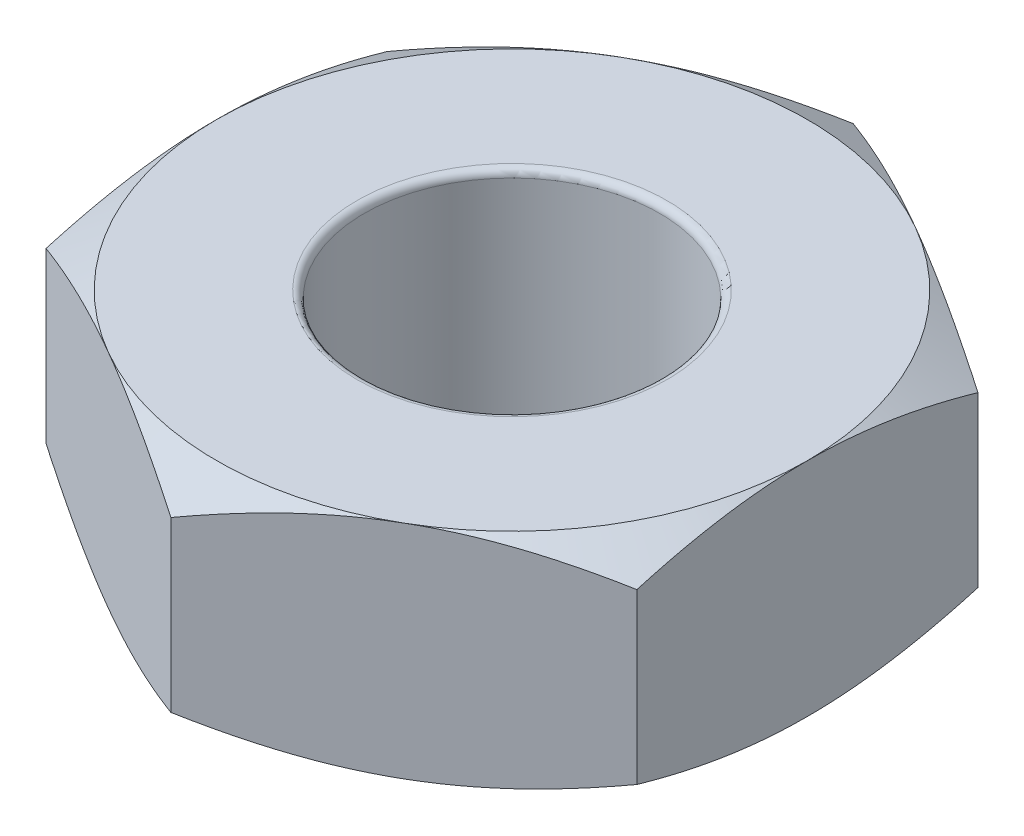
ISO-10303-21;
HEADER;
FILE_DESCRIPTION(('STEP AP214'),'2;1');
FILE_NAME('part.step','',(''),(''),'','','');
FILE_SCHEMA(('AUTOMOTIVE_DESIGN { 1 0 10303 214 1 1 1 1 }'));
ENDSEC;
DATA;
#1=APPLICATION_CONTEXT('core data for automotive mechanical design processes');
#2=APPLICATION_PROTOCOL_DEFINITION('international standard','automotive_design',2000,#1);
#3=PRODUCT_CONTEXT('',#1,'mechanical');
#4=PRODUCT('Part','Part','',(#3));
#5=PRODUCT_RELATED_PRODUCT_CATEGORY('part','',(#4));
#6=PRODUCT_DEFINITION_FORMATION('','',#4);
#7=PRODUCT_DEFINITION_CONTEXT('part definition',#1,'design');
#8=PRODUCT_DEFINITION('design','',#6,#7);
#9=PRODUCT_DEFINITION_SHAPE('','',#8);
#10=(LENGTH_UNIT() NAMED_UNIT(*) SI_UNIT(.MILLI.,.METRE.));
#11=(NAMED_UNIT(*) PLANE_ANGLE_UNIT() SI_UNIT($,.RADIAN.));
#12=(NAMED_UNIT(*) SI_UNIT($,.STERADIAN.) SOLID_ANGLE_UNIT());
#13=UNCERTAINTY_MEASURE_WITH_UNIT(LENGTH_MEASURE(1.E-05),#10,'distance_accuracy_value','');
#14=(GEOMETRIC_REPRESENTATION_CONTEXT(3) GLOBAL_UNCERTAINTY_ASSIGNED_CONTEXT((#13)) GLOBAL_UNIT_ASSIGNED_CONTEXT((#10,
#11,#12)) REPRESENTATION_CONTEXT('',''));
#15=CARTESIAN_POINT('',(0.,0.,0.));
#16=DIRECTION('',(0.,0.,1.));
#17=DIRECTION('',(1.,0.,0.));
#18=AXIS2_PLACEMENT_3D('',#15,#16,#17);
#19=CARTESIAN_POINT('',(0.,1.5,2.3094010767585));
#20=DIRECTION('',(-0.5,0.,-0.866025403784439));
#21=DIRECTION('',(-0.866025403784439,0.,0.5));
#22=AXIS2_PLACEMENT_3D('',#19,#20,#21);
#23=PLANE('',#22);
#24=CARTESIAN_POINT('',(2.0002,0.178699466620498,1.15458506832542));
#25=CARTESIAN_POINT('',(1.91230873709994,0.149389536100679,1.20532911262018));
#26=CARTESIAN_POINT('',(1.82365880552641,0.122732851980467,1.2565111744778));
#27=CARTESIAN_POINT('',(1.6448237530022,0.0762024910207216,1.3597616401932));
#28=CARTESIAN_POINT('',(1.55463545349496,0.0563452763827799,1.41183187919145));
#29=CARTESIAN_POINT('',(1.37537661423669,0.0254334640232534,1.51532701829183));
#30=CARTESIAN_POINT('',(1.2863336617737,0.014173151598532,1.56673599086578));
#31=CARTESIAN_POINT('',(1.10782860221496,0.0007286625946427,1.66979593505373));
#32=CARTESIAN_POINT('',(1.01836714429604,-0.00146664504653102,1.72144653186531));
#33=CARTESIAN_POINT('',(0.851191646451202,0.00309098933064962,1.81796535054794));
#34=CARTESIAN_POINT('',(0.773452629734216,0.00872487468701546,1.86284799277603));
#35=CARTESIAN_POINT('',(0.618481085463866,0.0265838952608292,1.95232085557725));
#36=CARTESIAN_POINT('',(0.541249094258801,0.0388151360234401,1.99691076648954));
#37=CARTESIAN_POINT('',(0.385957813517799,0.0693934368676104,2.08656822922816));
#38=CARTESIAN_POINT('',(0.30791818689262,0.0878701670657164,2.13162442866767));
#39=CARTESIAN_POINT('',(0.153003134307865,0.129805518212856,2.221064675979));
#40=CARTESIAN_POINT('',(0.0761257223768796,0.153254280492314,2.26544987045196));
#41=CARTESIAN_POINT('',(-0.000200000000000661,0.178699466620498,2.30951654681234));
#42=B_SPLINE_CURVE_WITH_KNOTS('',3,(#24,#25,#26,#27,#28,#29,#30,#31,#32,#33,#34,#35,#36,#37,#38,
#39,#40,#41),.UNSPECIFIED.,.F.,.F.,(4,2,2,2,2,2,2,2,4),(0.,0.31703182469561,0.634825876346563,
0.944753967652636,1.25430138000371,1.52387047293094,1.79368946861028,2.06949491027634,
2.34475850821472),.UNSPECIFIED.);
#43=CARTESIAN_POINT('',(2.,0.178632794954081,1.15470053837925));
#44=VERTEX_POINT('',#43);
#45=CARTESIAN_POINT('',(0.999999999999999,0.,1.73205080756888));
#46=VERTEX_POINT('',#45);
#47=EDGE_CURVE('E126',#44,#46,#42,.T.);
#48=ORIENTED_EDGE('',*,*,#47,.F.);
#49=DIRECTION('',(0.,-1.,0.));
#50=VECTOR('',#49,1.);
#51=CARTESIAN_POINT('',(2.,1.5,1.15470053837925));
#52=LINE('',#51,#50);
#53=CARTESIAN_POINT('',(2.,1.32136720504592,1.15470053837925));
#54=VERTEX_POINT('',#53);
#55=EDGE_CURVE('E232',#54,#44,#52,.T.);
#56=ORIENTED_EDGE('',*,*,#55,.F.);
#57=CARTESIAN_POINT('',(-0.000200000000000738,1.3213005333795,2.30951654681234));
#58=CARTESIAN_POINT('',(0.0876912629000595,1.35061046389932,2.25877250251758));
#59=CARTESIAN_POINT('',(0.176341194473591,1.37726714801953,2.20759044065996));
#60=CARTESIAN_POINT('',(0.355176246997802,1.42379750897928,2.10433997494456));
#61=CARTESIAN_POINT('',(0.445364546505036,1.44365472361722,2.05226973594631));
#62=CARTESIAN_POINT('',(0.624623385763305,1.47456653597675,1.94877459684592));
#63=CARTESIAN_POINT('',(0.713666338226303,1.48582684840147,1.89736562427197));
#64=CARTESIAN_POINT('',(0.892171397785043,1.49927133740536,1.79430568008403));
#65=CARTESIAN_POINT('',(0.981632855703958,1.50146664504653,1.74265508327244));
#66=CARTESIAN_POINT('',(1.1488083535488,1.49690901066935,1.64613626458982));
#67=CARTESIAN_POINT('',(1.22654737026578,1.49127512531298,1.60125362236173));
#68=CARTESIAN_POINT('',(1.38151891453613,1.47341610473917,1.51178075956051));
#69=CARTESIAN_POINT('',(1.4587509057412,1.46118486397656,1.46719084864821));
#70=CARTESIAN_POINT('',(1.6140421864822,1.43060656313239,1.37753338590959));
#71=CARTESIAN_POINT('',(1.69208181310738,1.41212983293428,1.33247718647009));
#72=CARTESIAN_POINT('',(1.84699686569213,1.37019448178714,1.24303693915876));
#73=CARTESIAN_POINT('',(1.92387427762312,1.34674571950769,1.1986517446858));
#74=CARTESIAN_POINT('',(2.0002,1.3213005333795,1.15458506832542));
#75=B_SPLINE_CURVE_WITH_KNOTS('',3,(#57,#58,#59,#60,#61,#62,#63,#64,#65,#66,#67,#68,#69,#70,#71,
#72,#73,#74),.UNSPECIFIED.,.F.,.F.,(4,2,2,2,2,2,2,2,4),(0.,0.31703182469561,0.634825876346563,
0.944753967652636,1.25430138000371,1.52387047293094,1.79368946861028,2.06949491027634,
2.34475850821472),.UNSPECIFIED.);
#76=CARTESIAN_POINT('',(1.,1.5,1.73205080756888));
#77=VERTEX_POINT('',#76);
#78=EDGE_CURVE('E373',#77,#54,#75,.T.);
#79=ORIENTED_EDGE('',*,*,#78,.F.);
#80=CARTESIAN_POINT('',(0.,1.32136720504592,2.3094010767585));
#81=VERTEX_POINT('',#80);
#82=EDGE_CURVE('E362',#81,#77,#75,.T.);
#83=ORIENTED_EDGE('',*,*,#82,.F.);
#84=DIRECTION('',(0.,-1.,0.));
#85=VECTOR('',#84,1.);
#86=CARTESIAN_POINT('',(0.,1.5,2.3094010767585));
#87=LINE('',#86,#85);
#88=CARTESIAN_POINT('',(0.,0.178632794954081,2.3094010767585));
#89=VERTEX_POINT('',#88);
#90=EDGE_CURVE('E161',#81,#89,#87,.T.);
#91=ORIENTED_EDGE('',*,*,#90,.T.);
#92=EDGE_CURVE('E139',#46,#89,#42,.T.);
#93=ORIENTED_EDGE('',*,*,#92,.F.);
#94=EDGE_LOOP('',(#48,#56,#79,#83,#91,#93));
#95=FACE_BOUND('',#94,.T.);
#96=ADVANCED_FACE('F37',(#95),#23,.F.);
#97=CARTESIAN_POINT('',(2.,1.5,1.15470053837925));
#98=DIRECTION('',(-1.,0.,0.));
#99=DIRECTION('',(0.,0.,1.));
#100=AXIS2_PLACEMENT_3D('',#97,#98,#99);
#101=PLANE('',#100);
#102=CARTESIAN_POINT('',(2.,1.38024356206323,-3.90868581202231));
#103=CARTESIAN_POINT('',(2.,1.33338477520942,-3.81751112169325));
#104=CARTESIAN_POINT('',(2.,1.28679021631781,-3.72620145046507));
#105=CARTESIAN_POINT('',(2.,1.19424910626193,-3.54325228824929));
#106=CARTESIAN_POINT('',(2.,1.14830256761152,-3.45161279093522));
#107=CARTESIAN_POINT('',(2.,1.01146715761723,-3.17581300243889));
#108=CARTESIAN_POINT('',(2.,0.921737415753044,-2.9910709203634));
#109=CARTESIAN_POINT('',(2.,0.788409395654005,-2.70743624323685));
#110=CARTESIAN_POINT('',(2.,0.743100656319978,-2.60934831774003));
#111=CARTESIAN_POINT('',(2.,0.654163775473777,-2.41241507533712));
#112=CARTESIAN_POINT('',(2.,0.610535569794257,-2.31356978752232));
#113=CARTESIAN_POINT('',(2.,0.525465312630819,-2.11501734395706));
#114=CARTESIAN_POINT('',(2.,0.484021797433511,-2.0153108187193));
#115=CARTESIAN_POINT('',(2.,0.403937006613858,-1.81474539793162));
#116=CARTESIAN_POINT('',(2.,0.365296392668009,-1.71388623674348));
#117=CARTESIAN_POINT('',(2.,0.285617620657406,-1.49400593807688));
#118=CARTESIAN_POINT('',(2.,0.245241020544741,-1.37474151517002));
#119=CARTESIAN_POINT('',(2.,0.171425178991217,-1.13410850020832));
#120=CARTESIAN_POINT('',(2.,0.137982386760639,-1.0127410198025));
#121=CARTESIAN_POINT('',(2.,0.0810163135177487,-0.770071934944817));
#122=CARTESIAN_POINT('',(2.,0.0573164449831604,-0.648812992268316));
#123=CARTESIAN_POINT('',(2.,0.0214266196550799,-0.404608758962328));
#124=CARTESIAN_POINT('',(2.,0.00922997508793512,-0.281664490388411));
#125=CARTESIAN_POINT('',(2.,-0.00207085477321416,-0.0335419748269813));
#126=CARTESIAN_POINT('',(2.,-0.00100267071105161,0.0916445286709646));
#127=CARTESIAN_POINT('',(2.,0.014484045237909,0.341193409529001));
#128=CARTESIAN_POINT('',(2.,0.0289073543713882,0.465555475947227));
#129=CARTESIAN_POINT('',(2.,0.0695474304125029,0.714833183390077));
#130=CARTESIAN_POINT('',(2.,0.0959955839540994,0.839709642184881));
#131=CARTESIAN_POINT('',(2.,0.157986894429598,1.08715459095749));
#132=CARTESIAN_POINT('',(2.,0.193532661864587,1.20972240762972));
#133=CARTESIAN_POINT('',(2.,0.269280519283634,1.44650470413582));
#134=CARTESIAN_POINT('',(2.,0.309153182000627,1.56082665519536));
#135=CARTESIAN_POINT('',(2.,0.393292544621002,1.78785420479763));
#136=CARTESIAN_POINT('',(2.,0.437560254612616,1.90055942493322));
#137=CARTESIAN_POINT('',(2.,0.529372373860237,2.12474648121528));
#138=CARTESIAN_POINT('',(2.,0.576919977737399,2.23622699843601));
#139=CARTESIAN_POINT('',(2.,0.674434984945331,2.45812606854002));
#140=CARTESIAN_POINT('',(2.,0.724402516378928,2.56854456483182));
#141=CARTESIAN_POINT('',(2.,0.823331957292793,2.78238975570627));
#142=CARTESIAN_POINT('',(2.,0.87219431445944,2.88586269009035));
#143=CARTESIAN_POINT('',(2.,0.971202074310625,3.09219555395059));
#144=CARTESIAN_POINT('',(2.,1.02134751719606,3.19505546409504));
#145=CARTESIAN_POINT('',(2.,1.12249261908677,3.39994809054478));
#146=CARTESIAN_POINT('',(2.,1.1734890679984,3.50198239517474));
#147=CARTESIAN_POINT('',(2.,1.27629914354312,3.70562803087648));
#148=CARTESIAN_POINT('',(2.,1.32811270118693,3.80723939675146));
#149=CARTESIAN_POINT('',(2.,1.38024356206323,3.90868581202231));
#150=B_SPLINE_CURVE_WITH_KNOTS('',3,(#102,#103,#104,#105,#106,#107,#108,#109,#110,#111,#112,
#113,#114,#115,#116,#117,#118,#119,#120,#121,#122,#123,#124,#125,#126,#127,#128,#129,#130,#131,
#132,#133,#134,#135,#136,#137,#138,#139,#140,#141,#142,#143,#144,#145,#146,#147,#148,#149),
.UNSPECIFIED.,.F.,.F.,(4,2,2,2,2,2,2,2,2,2,2,2,2,2,2,2,2,2,2,2,2,2,2,4),(0.,0.307531563856156,
0.615069058317579,1.23115557383005,1.55528461857819,1.8794012749051,2.2032979430231,
2.52727082574406,2.9048604545366,3.28225624019068,3.65247322929854,4.02247484779028,
4.39728941630346,4.77223811112903,5.15472880172826,5.53732936883045,5.90044039858863,
6.26363507408059,6.6271886376078,6.99076146751935,7.33404016464889,7.67732963038956,
8.01953135999518,8.36170435024386),.UNSPECIFIED.);
#151=CARTESIAN_POINT('',(2.,0.178632794954081,-1.15470053837925));
#152=VERTEX_POINT('',#151);
#153=CARTESIAN_POINT('',(2.,0.,0.));
#154=VERTEX_POINT('',#153);
#155=EDGE_CURVE('E52',#152,#154,#150,.T.);
#156=ORIENTED_EDGE('',*,*,#155,.F.);
#157=DIRECTION('',(0.,-1.,0.));
#158=VECTOR('',#157,1.);
#159=CARTESIAN_POINT('',(2.,1.5,-1.15470053837925));
#160=LINE('',#159,#158);
#161=CARTESIAN_POINT('',(2.,1.32136720504592,-1.15470053837925));
#162=VERTEX_POINT('',#161);
#163=EDGE_CURVE('E365',#162,#152,#160,.T.);
#164=ORIENTED_EDGE('',*,*,#163,.F.);
#165=CARTESIAN_POINT('',(2.,0.119756437936774,3.90868581202231));
#166=CARTESIAN_POINT('',(2.,0.166615224790583,3.81751112169325));
#167=CARTESIAN_POINT('',(2.,0.213209783682192,3.72620145046507));
#168=CARTESIAN_POINT('',(2.,0.305750893738073,3.54325228824929));
#169=CARTESIAN_POINT('',(2.,0.351697432388483,3.45161279093522));
#170=CARTESIAN_POINT('',(2.,0.488532842382773,3.1758130024389));
#171=CARTESIAN_POINT('',(2.,0.578262584246956,2.9910709203634));
#172=CARTESIAN_POINT('',(2.,0.711590604345995,2.70743624323685));
#173=CARTESIAN_POINT('',(2.,0.756899343680022,2.60934831774003));
#174=CARTESIAN_POINT('',(2.,0.845836224526223,2.41241507533712));
#175=CARTESIAN_POINT('',(2.,0.889464430205743,2.31356978752232));
#176=CARTESIAN_POINT('',(2.,0.97453468736918,2.11501734395706));
#177=CARTESIAN_POINT('',(2.,1.01597820256649,2.0153108187193));
#178=CARTESIAN_POINT('',(2.,1.09606299338614,1.81474539793162));
#179=CARTESIAN_POINT('',(2.,1.13470360733199,1.71388623674348));
#180=CARTESIAN_POINT('',(2.,1.21438237934259,1.49400593807688));
#181=CARTESIAN_POINT('',(2.,1.25475897945526,1.37474151517002));
#182=CARTESIAN_POINT('',(2.,1.32857482100878,1.13410850020832));
#183=CARTESIAN_POINT('',(2.,1.36201761323936,1.0127410198025));
#184=CARTESIAN_POINT('',(2.,1.41898368648225,0.770071934944819));
#185=CARTESIAN_POINT('',(2.,1.44268355501684,0.648812992268318));
#186=CARTESIAN_POINT('',(2.,1.47857338034492,0.40460875896233));
#187=CARTESIAN_POINT('',(2.,1.49077002491207,0.281664490388413));
#188=CARTESIAN_POINT('',(2.,1.50207085477321,0.0335419748269832));
#189=CARTESIAN_POINT('',(2.,1.50100267071105,-0.0916445286709627));
#190=CARTESIAN_POINT('',(2.,1.48551595476209,-0.341193409528999));
#191=CARTESIAN_POINT('',(2.,1.47109264562861,-0.465555475947225));
#192=CARTESIAN_POINT('',(2.,1.4304525695875,-0.714833183390076));
#193=CARTESIAN_POINT('',(2.,1.4040044160459,-0.83970964218488));
#194=CARTESIAN_POINT('',(2.,1.3420131055704,-1.08715459095749));
#195=CARTESIAN_POINT('',(2.,1.30646733813541,-1.20972240762972));
#196=CARTESIAN_POINT('',(2.,1.23071948071637,-1.44650470413582));
#197=CARTESIAN_POINT('',(2.,1.19084681799937,-1.56082665519536));
#198=CARTESIAN_POINT('',(2.,1.106707455379,-1.78785420479763));
#199=CARTESIAN_POINT('',(2.,1.06243974538738,-1.90055942493322));
#200=CARTESIAN_POINT('',(2.,0.970627626139764,-2.12474648121528));
#201=CARTESIAN_POINT('',(2.,0.923080022262602,-2.23622699843601));
#202=CARTESIAN_POINT('',(2.,0.825565015054669,-2.45812606854002));
#203=CARTESIAN_POINT('',(2.,0.775597483621072,-2.56854456483182));
#204=CARTESIAN_POINT('',(2.,0.676668042707207,-2.78238975570627));
#205=CARTESIAN_POINT('',(2.,0.62780568554056,-2.88586269009035));
#206=CARTESIAN_POINT('',(2.,0.528797925689375,-3.09219555395059));
#207=CARTESIAN_POINT('',(2.,0.478652482803937,-3.19505546409504));
#208=CARTESIAN_POINT('',(2.,0.377507380913226,-3.39994809054478));
#209=CARTESIAN_POINT('',(2.,0.3265109320016,-3.50198239517474));
#210=CARTESIAN_POINT('',(2.,0.223700856456884,-3.70562803087648));
#211=CARTESIAN_POINT('',(2.,0.171887298813068,-3.80723939675146));
#212=CARTESIAN_POINT('',(2.,0.119756437936775,-3.90868581202231));
#213=B_SPLINE_CURVE_WITH_KNOTS('',3,(#165,#166,#167,#168,#169,#170,#171,#172,#173,#174,#175,
#176,#177,#178,#179,#180,#181,#182,#183,#184,#185,#186,#187,#188,#189,#190,#191,#192,#193,#194,
#195,#196,#197,#198,#199,#200,#201,#202,#203,#204,#205,#206,#207,#208,#209,#210,#211,#212),
.UNSPECIFIED.,.F.,.F.,(4,2,2,2,2,2,2,2,2,2,2,2,2,2,2,2,2,2,2,2,2,2,2,4),(0.,0.307531563856156,
0.615069058317579,1.23115557383005,1.55528461857819,1.8794012749051,2.2032979430231,
2.52727082574406,2.9048604545366,3.28225624019068,3.65247322929854,4.02247484779028,
4.39728941630346,4.77223811112903,5.15472880172826,5.53732936883045,5.90044039858863,
6.2636350740806,6.6271886376078,6.99076146751935,7.33404016464889,7.67732963038957,
8.01953135999518,8.36170435024386),.UNSPECIFIED.);
#214=CARTESIAN_POINT('',(2.,1.5,0.));
#215=VERTEX_POINT('',#214);
#216=EDGE_CURVE('E272',#215,#162,#213,.T.);
#217=ORIENTED_EDGE('',*,*,#216,.F.);
#218=EDGE_CURVE('E372',#54,#215,#213,.T.);
#219=ORIENTED_EDGE('',*,*,#218,.F.);
#220=ORIENTED_EDGE('',*,*,#55,.T.);
#221=EDGE_CURVE('E133',#154,#44,#150,.T.);
#222=ORIENTED_EDGE('',*,*,#221,.F.);
#223=EDGE_LOOP('',(#156,#164,#217,#219,#220,#222));
#224=FACE_BOUND('',#223,.T.);
#225=ADVANCED_FACE('F257',(#224),#101,.F.);
#226=CARTESIAN_POINT('',(2.,1.5,-1.15470053837925));
#227=DIRECTION('',(-0.5,0.,0.866025403784438));
#228=DIRECTION('',(0.866025403784439,0.,0.5));
#229=AXIS2_PLACEMENT_3D('',#226,#227,#228);
#230=PLANE('',#229);
#231=CARTESIAN_POINT('',(-0.0002,0.178699466620498,-2.30951654681234));
#232=CARTESIAN_POINT('',(0.0876912629000601,0.14938953610068,-2.25877250251758));
#233=CARTESIAN_POINT('',(0.176341194473591,0.122732851980468,-2.20759044065996));
#234=CARTESIAN_POINT('',(0.355176246997802,0.0762024910207219,-2.10433997494456));
#235=CARTESIAN_POINT('',(0.445364546505037,0.05634527638278,-2.05226973594631));
#236=CARTESIAN_POINT('',(0.624623385763306,0.0254334640232533,-1.94877459684592));
#237=CARTESIAN_POINT('',(0.713666338226304,0.0141731515985319,-1.89736562427197));
#238=CARTESIAN_POINT('',(0.892171397785043,0.000728662594642689,-1.79430568008402));
#239=CARTESIAN_POINT('',(0.981632855703958,-0.00146664504653088,-1.74265508327244));
#240=CARTESIAN_POINT('',(1.1488083535488,0.00309098933064962,-1.64613626458981));
#241=CARTESIAN_POINT('',(1.22654737026578,0.00872487468701521,-1.60125362236173));
#242=CARTESIAN_POINT('',(1.38151891453613,0.0265838952608289,-1.51178075956051));
#243=CARTESIAN_POINT('',(1.4587509057412,0.03881513602344,-1.46719084864821));
#244=CARTESIAN_POINT('',(1.6140421864822,0.0693934368676104,-1.37753338590959));
#245=CARTESIAN_POINT('',(1.69208181310738,0.0878701670657164,-1.33247718647009));
#246=CARTESIAN_POINT('',(1.84699686569214,0.129805518212856,-1.24303693915875));
#247=CARTESIAN_POINT('',(1.92387427762312,0.153254280492314,-1.1986517446858));
#248=CARTESIAN_POINT('',(2.0002,0.178699466620498,-1.15458506832541));
#249=B_SPLINE_CURVE_WITH_KNOTS('',3,(#231,#232,#233,#234,#235,#236,#237,#238,#239,#240,#241,
#242,#243,#244,#245,#246,#247,#248),.UNSPECIFIED.,.F.,.F.,(4,2,2,2,2,2,2,2,4),(0.,
0.31703182469561,0.634825876346564,0.944753967652636,1.25430138000371,1.52387047293094,
1.79368946861028,2.06949491027634,2.34475850821472),.UNSPECIFIED.);
#250=CARTESIAN_POINT('',(0.,0.178632794954082,-2.3094010767585));
#251=VERTEX_POINT('',#250);
#252=CARTESIAN_POINT('',(1.,0.,-1.73205080756888));
#253=VERTEX_POINT('',#252);
#254=EDGE_CURVE('E60',#251,#253,#249,.T.);
#255=ORIENTED_EDGE('',*,*,#254,.F.);
#256=DIRECTION('',(0.,-1.,0.));
#257=VECTOR('',#256,1.);
#258=CARTESIAN_POINT('',(0.,1.5,-2.3094010767585));
#259=LINE('',#258,#257);
#260=CARTESIAN_POINT('',(0.,1.32136720504592,-2.3094010767585));
#261=VERTEX_POINT('',#260);
#262=EDGE_CURVE('E360',#261,#251,#259,.T.);
#263=ORIENTED_EDGE('',*,*,#262,.F.);
#264=CARTESIAN_POINT('',(2.0002,1.3213005333795,-1.15458506832541));
#265=CARTESIAN_POINT('',(1.91230873709994,1.35061046389932,-1.20532911262018));
#266=CARTESIAN_POINT('',(1.82365880552641,1.37726714801953,-1.2565111744778));
#267=CARTESIAN_POINT('',(1.6448237530022,1.42379750897928,-1.35976164019319));
#268=CARTESIAN_POINT('',(1.55463545349496,1.44365472361722,-1.41183187919145));
#269=CARTESIAN_POINT('',(1.37537661423669,1.47456653597675,-1.51532701829183));
#270=CARTESIAN_POINT('',(1.2863336617737,1.48582684840147,-1.56673599086578));
#271=CARTESIAN_POINT('',(1.10782860221496,1.49927133740536,-1.66979593505373));
#272=CARTESIAN_POINT('',(1.01836714429604,1.50146664504653,-1.72144653186531));
#273=CARTESIAN_POINT('',(0.851191646451202,1.49690901066935,-1.81796535054794));
#274=CARTESIAN_POINT('',(0.773452629734217,1.49127512531298,-1.86284799277603));
#275=CARTESIAN_POINT('',(0.618481085463867,1.47341610473917,-1.95232085557725));
#276=CARTESIAN_POINT('',(0.541249094258802,1.46118486397656,-1.99691076648954));
#277=CARTESIAN_POINT('',(0.385957813517799,1.43060656313239,-2.08656822922816));
#278=CARTESIAN_POINT('',(0.307918186892621,1.41212983293428,-2.13162442866767));
#279=CARTESIAN_POINT('',(0.153003134307865,1.37019448178714,-2.221064675979));
#280=CARTESIAN_POINT('',(0.07612572237688,1.34674571950769,-2.26544987045196));
#281=CARTESIAN_POINT('',(-0.00020000000000016,1.3213005333795,-2.30951654681234));
#282=B_SPLINE_CURVE_WITH_KNOTS('',3,(#264,#265,#266,#267,#268,#269,#270,#271,#272,#273,#274,
#275,#276,#277,#278,#279,#280,#281),.UNSPECIFIED.,.F.,.F.,(4,2,2,2,2,2,2,2,4),(0.,
0.31703182469561,0.634825876346563,0.944753967652635,1.25430138000371,1.52387047293094,
1.79368946861028,2.06949491027634,2.34475850821472),.UNSPECIFIED.);
#283=CARTESIAN_POINT('',(1.,1.5,-1.73205080756888));
#284=VERTEX_POINT('',#283);
#285=EDGE_CURVE('E321',#284,#261,#282,.T.);
#286=ORIENTED_EDGE('',*,*,#285,.F.);
#287=EDGE_CURVE('E379',#162,#284,#282,.T.);
#288=ORIENTED_EDGE('',*,*,#287,.F.);
#289=ORIENTED_EDGE('',*,*,#163,.T.);
#290=EDGE_CURVE('E199',#253,#152,#249,.T.);
#291=ORIENTED_EDGE('',*,*,#290,.F.);
#292=EDGE_LOOP('',(#255,#263,#286,#288,#289,#291));
#293=FACE_BOUND('',#292,.T.);
#294=ADVANCED_FACE('F261',(#293),#230,.F.);
#295=CARTESIAN_POINT('',(0.,1.5,-2.3094010767585));
#296=DIRECTION('',(0.5,0.,0.866025403784439));
#297=DIRECTION('',(0.866025403784439,0.,-0.5));
#298=AXIS2_PLACEMENT_3D('',#295,#296,#297);
#299=PLANE('',#298);
#300=CARTESIAN_POINT('',(-2.0002,0.178699466620498,-1.15458506832542));
#301=CARTESIAN_POINT('',(-1.91230873709994,0.14938953610068,-1.20532911262018));
#302=CARTESIAN_POINT('',(-1.82365880552641,0.122732851980468,-1.2565111744778));
#303=CARTESIAN_POINT('',(-1.6448237530022,0.0762024910207219,-1.3597616401932));
#304=CARTESIAN_POINT('',(-1.55463545349496,0.0563452763827799,-1.41183187919145));
#305=CARTESIAN_POINT('',(-1.37537661423669,0.0254334640232533,-1.51532701829183));
#306=CARTESIAN_POINT('',(-1.2863336617737,0.0141731515985321,-1.56673599086578));
#307=CARTESIAN_POINT('',(-1.10782860221496,0.000728662594642999,-1.66979593505373));
#308=CARTESIAN_POINT('',(-1.01836714429604,-0.00146664504653067,-1.72144653186531));
#309=CARTESIAN_POINT('',(-0.851191646451202,0.00309098933064985,-1.81796535054794));
#310=CARTESIAN_POINT('',(-0.773452629734217,0.00872487468701556,-1.86284799277603));
#311=CARTESIAN_POINT('',(-0.618481085463867,0.0265838952608294,-1.95232085557725));
#312=CARTESIAN_POINT('',(-0.541249094258802,0.0388151360234405,-1.99691076648954));
#313=CARTESIAN_POINT('',(-0.385957813517799,0.0693934368676109,-2.08656822922816));
#314=CARTESIAN_POINT('',(-0.307918186892621,0.0878701670657169,-2.13162442866767));
#315=CARTESIAN_POINT('',(-0.153003134307865,0.129805518212857,-2.221064675979));
#316=CARTESIAN_POINT('',(-0.07612572237688,0.153254280492314,-2.26544987045196));
#317=CARTESIAN_POINT('',(0.000199999999999946,0.178699466620498,-2.30951654681234));
#318=B_SPLINE_CURVE_WITH_KNOTS('',3,(#300,#301,#302,#303,#304,#305,#306,#307,#308,#309,#310,
#311,#312,#313,#314,#315,#316,#317),.UNSPECIFIED.,.F.,.F.,(4,2,2,2,2,2,2,2,4),(0.,
0.31703182469561,0.634825876346564,0.944753967652636,1.25430138000371,1.52387047293094,
1.79368946861028,2.06949491027634,2.34475850821472),.UNSPECIFIED.);
#319=CARTESIAN_POINT('',(-2.,0.178632794954075,-1.15470053837926));
#320=VERTEX_POINT('',#319);
#321=CARTESIAN_POINT('',(-1.,0.,-1.73205080756888));
#322=VERTEX_POINT('',#321);
#323=EDGE_CURVE('E177',#320,#322,#318,.T.);
#324=ORIENTED_EDGE('',*,*,#323,.F.);
#325=DIRECTION('',(0.,-1.,0.));
#326=VECTOR('',#325,1.);
#327=CARTESIAN_POINT('',(-2.,1.5,-1.15470053837925));
#328=LINE('',#327,#326);
#329=CARTESIAN_POINT('',(-2.,1.32136720504592,-1.15470053837925));
#330=VERTEX_POINT('',#329);
#331=EDGE_CURVE('E328',#330,#320,#328,.T.);
#332=ORIENTED_EDGE('',*,*,#331,.F.);
#333=CARTESIAN_POINT('',(0.000200000000000046,1.3213005333795,-2.30951654681234));
#334=CARTESIAN_POINT('',(-0.08769126290006,1.35061046389932,-2.25877250251758));
#335=CARTESIAN_POINT('',(-0.176341194473591,1.37726714801953,-2.20759044065996));
#336=CARTESIAN_POINT('',(-0.355176246997802,1.42379750897928,-2.10433997494456));
#337=CARTESIAN_POINT('',(-0.445364546505037,1.44365472361722,-2.05226973594631));
#338=CARTESIAN_POINT('',(-0.624623385763306,1.47456653597675,-1.94877459684592));
#339=CARTESIAN_POINT('',(-0.713666338226304,1.48582684840147,-1.89736562427197));
#340=CARTESIAN_POINT('',(-0.892171397785043,1.49927133740536,-1.79430568008403));
#341=CARTESIAN_POINT('',(-0.981632855703959,1.50146664504653,-1.74265508327244));
#342=CARTESIAN_POINT('',(-1.1488083535488,1.49690901066935,-1.64613626458982));
#343=CARTESIAN_POINT('',(-1.22654737026578,1.49127512531298,-1.60125362236173));
#344=CARTESIAN_POINT('',(-1.38151891453613,1.47341610473917,-1.51178075956051));
#345=CARTESIAN_POINT('',(-1.4587509057412,1.46118486397656,-1.46719084864821));
#346=CARTESIAN_POINT('',(-1.6140421864822,1.43060656313239,-1.37753338590959));
#347=CARTESIAN_POINT('',(-1.69208181310738,1.41212983293428,-1.33247718647009));
#348=CARTESIAN_POINT('',(-1.84699686569214,1.37019448178714,-1.24303693915876));
#349=CARTESIAN_POINT('',(-1.92387427762312,1.34674571950769,-1.1986517446858));
#350=CARTESIAN_POINT('',(-2.0002,1.3213005333795,-1.15458506832542));
#351=B_SPLINE_CURVE_WITH_KNOTS('',3,(#333,#334,#335,#336,#337,#338,#339,#340,#341,#342,#343,
#344,#345,#346,#347,#348,#349,#350),.UNSPECIFIED.,.F.,.F.,(4,2,2,2,2,2,2,2,4),(0.,
0.31703182469561,0.634825876346564,0.944753967652636,1.25430138000371,1.52387047293094,
1.79368946861028,2.06949491027634,2.34475850821472),.UNSPECIFIED.);
#352=CARTESIAN_POINT('',(-1.,1.5,-1.73205080756888));
#353=VERTEX_POINT('',#352);
#354=EDGE_CURVE('E312',#353,#330,#351,.T.);
#355=ORIENTED_EDGE('',*,*,#354,.F.);
#356=EDGE_CURVE('E317',#261,#353,#351,.T.);
#357=ORIENTED_EDGE('',*,*,#356,.F.);
#358=ORIENTED_EDGE('',*,*,#262,.T.);
#359=EDGE_CURVE('E283',#322,#251,#318,.T.);
#360=ORIENTED_EDGE('',*,*,#359,.F.);
#361=EDGE_LOOP('',(#324,#332,#355,#357,#358,#360));
#362=FACE_BOUND('',#361,.T.);
#363=ADVANCED_FACE('F266',(#362),#299,.F.);
#364=CARTESIAN_POINT('',(-2.,1.5,-1.15470053837925));
#365=DIRECTION('',(1.,0.,0.));
#366=DIRECTION('',(0.,0.,-1.));
#367=AXIS2_PLACEMENT_3D('',#364,#365,#366);
#368=PLANE('',#367);
#369=CARTESIAN_POINT('',(-2.,1.38024356206322,3.9086858120223));
#370=CARTESIAN_POINT('',(-2.,1.33338477520942,3.81751112169324));
#371=CARTESIAN_POINT('',(-2.,1.28679021631781,3.72620145046507));
#372=CARTESIAN_POINT('',(-2.,1.19424910626193,3.54325228824929));
#373=CARTESIAN_POINT('',(-2.,1.14830256761152,3.45161279093522));
#374=CARTESIAN_POINT('',(-2.,1.01146715761723,3.17581300243889));
#375=CARTESIAN_POINT('',(-2.,0.921737415753044,2.9910709203634));
#376=CARTESIAN_POINT('',(-2.,0.788409395654005,2.70743624323685));
#377=CARTESIAN_POINT('',(-2.,0.743100656319978,2.60934831774002));
#378=CARTESIAN_POINT('',(-2.,0.654163775473777,2.41241507533712));
#379=CARTESIAN_POINT('',(-2.,0.610535569794257,2.31356978752232));
#380=CARTESIAN_POINT('',(-2.,0.52546531263082,2.11501734395706));
#381=CARTESIAN_POINT('',(-2.,0.484021797433511,2.0153108187193));
#382=CARTESIAN_POINT('',(-2.,0.403937006613859,1.81474539793162));
#383=CARTESIAN_POINT('',(-2.,0.36529639266801,1.71388623674348));
#384=CARTESIAN_POINT('',(-2.,0.285617620657407,1.49400593807688));
#385=CARTESIAN_POINT('',(-2.,0.245241020544742,1.37474151517002));
#386=CARTESIAN_POINT('',(-2.,0.171425178991218,1.13410850020832));
#387=CARTESIAN_POINT('',(-2.,0.13798238676064,1.0127410198025));
#388=CARTESIAN_POINT('',(-2.,0.0810163135177492,0.770071934944817));
#389=CARTESIAN_POINT('',(-2.,0.0573164449831608,0.648812992268316));
#390=CARTESIAN_POINT('',(-2.,0.0214266196550805,0.404608758962328));
#391=CARTESIAN_POINT('',(-2.,0.00922997508793581,0.281664490388411));
#392=CARTESIAN_POINT('',(-2.,-0.00207085477321335,0.0335419748269811));
#393=CARTESIAN_POINT('',(-2.,-0.00100267071105085,-0.0916445286709648));
#394=CARTESIAN_POINT('',(-2.,0.0144840452379097,-0.341193409529001));
#395=CARTESIAN_POINT('',(-2.,0.028907354371389,-0.465555475947227));
#396=CARTESIAN_POINT('',(-2.,0.0695474304125037,-0.714833183390078));
#397=CARTESIAN_POINT('',(-2.,0.0959955839541001,-0.839709642184882));
#398=CARTESIAN_POINT('',(-2.,0.157986894429598,-1.08715459095749));
#399=CARTESIAN_POINT('',(-2.,0.193532661864588,-1.20972240762972));
#400=CARTESIAN_POINT('',(-2.,0.269280519283635,-1.44650470413582));
#401=CARTESIAN_POINT('',(-2.,0.309153182000628,-1.56082665519536));
#402=CARTESIAN_POINT('',(-2.,0.393292544621003,-1.78785420479763));
#403=CARTESIAN_POINT('',(-2.,0.437560254612617,-1.90055942493322));
#404=CARTESIAN_POINT('',(-2.,0.529372373860237,-2.12474648121528));
#405=CARTESIAN_POINT('',(-2.,0.576919977737399,-2.23622699843601));
#406=CARTESIAN_POINT('',(-2.,0.674434984945331,-2.45812606854002));
#407=CARTESIAN_POINT('',(-2.,0.724402516378928,-2.56854456483182));
#408=CARTESIAN_POINT('',(-2.,0.823331957292793,-2.78238975570627));
#409=CARTESIAN_POINT('',(-2.,0.87219431445944,-2.88586269009035));
#410=CARTESIAN_POINT('',(-2.,0.971202074310626,-3.09219555395059));
#411=CARTESIAN_POINT('',(-2.,1.02134751719606,-3.19505546409504));
#412=CARTESIAN_POINT('',(-2.,1.12249261908677,-3.39994809054478));
#413=CARTESIAN_POINT('',(-2.,1.1734890679984,-3.50198239517474));
#414=CARTESIAN_POINT('',(-2.,1.27629914354312,-3.70562803087648));
#415=CARTESIAN_POINT('',(-2.,1.32811270118693,-3.80723939675146));
#416=CARTESIAN_POINT('',(-2.,1.38024356206323,-3.90868581202231));
#417=B_SPLINE_CURVE_WITH_KNOTS('',3,(#369,#370,#371,#372,#373,#374,#375,#376,#377,#378,#379,
#380,#381,#382,#383,#384,#385,#386,#387,#388,#389,#390,#391,#392,#393,#394,#395,#396,#397,#398,
#399,#400,#401,#402,#403,#404,#405,#406,#407,#408,#409,#410,#411,#412,#413,#414,#415,#416),
.UNSPECIFIED.,.F.,.F.,(4,2,2,2,2,2,2,2,2,2,2,2,2,2,2,2,2,2,2,2,2,2,2,4),(0.,0.307531563856156,
0.615069058317578,1.23115557383005,1.55528461857819,1.8794012749051,2.20329794302309,
2.52727082574405,2.9048604545366,3.28225624019068,3.65247322929853,4.02247484779028,
4.39728941630346,4.77223811112903,5.15472880172826,5.53732936883045,5.90044039858863,
6.26363507408059,6.62718863760779,6.99076146751935,7.33404016464889,7.67732963038956,
8.01953135999518,8.36170435024385),.UNSPECIFIED.);
#418=CARTESIAN_POINT('',(-2.,0.178632794954081,1.15470053837925));
#419=VERTEX_POINT('',#418);
#420=CARTESIAN_POINT('',(-2.,0.,0.));
#421=VERTEX_POINT('',#420);
#422=EDGE_CURVE('E162',#419,#421,#417,.T.);
#423=ORIENTED_EDGE('',*,*,#422,.F.);
#424=DIRECTION('',(0.,-1.,0.));
#425=VECTOR('',#424,1.);
#426=CARTESIAN_POINT('',(-2.,1.5,1.15470053837925));
#427=LINE('',#426,#425);
#428=CARTESIAN_POINT('',(-2.,1.32136720504592,1.15470053837925));
#429=VERTEX_POINT('',#428);
#430=EDGE_CURVE('E354',#429,#419,#427,.T.);
#431=ORIENTED_EDGE('',*,*,#430,.F.);
#432=CARTESIAN_POINT('',(-2.,0.119756437936774,-3.90868581202231));
#433=CARTESIAN_POINT('',(-2.,0.166615224790583,-3.81751112169325));
#434=CARTESIAN_POINT('',(-2.,0.213209783682192,-3.72620145046507));
#435=CARTESIAN_POINT('',(-2.,0.305750893738073,-3.54325228824929));
#436=CARTESIAN_POINT('',(-2.,0.351697432388483,-3.45161279093522));
#437=CARTESIAN_POINT('',(-2.,0.488532842382773,-3.1758130024389));
#438=CARTESIAN_POINT('',(-2.,0.578262584246955,-2.9910709203634));
#439=CARTESIAN_POINT('',(-2.,0.711590604345995,-2.70743624323685));
#440=CARTESIAN_POINT('',(-2.,0.756899343680021,-2.60934831774003));
#441=CARTESIAN_POINT('',(-2.,0.845836224526222,-2.41241507533712));
#442=CARTESIAN_POINT('',(-2.,0.889464430205742,-2.31356978752232));
#443=CARTESIAN_POINT('',(-2.,0.97453468736918,-2.11501734395706));
#444=CARTESIAN_POINT('',(-2.,1.01597820256649,-2.0153108187193));
#445=CARTESIAN_POINT('',(-2.,1.09606299338614,-1.81474539793162));
#446=CARTESIAN_POINT('',(-2.,1.13470360733199,-1.71388623674348));
#447=CARTESIAN_POINT('',(-2.,1.21438237934259,-1.49400593807688));
#448=CARTESIAN_POINT('',(-2.,1.25475897945526,-1.37474151517002));
#449=CARTESIAN_POINT('',(-2.,1.32857482100878,-1.13410850020832));
#450=CARTESIAN_POINT('',(-2.,1.36201761323936,-1.0127410198025));
#451=CARTESIAN_POINT('',(-2.,1.41898368648225,-0.770071934944818));
#452=CARTESIAN_POINT('',(-2.,1.44268355501684,-0.648812992268316));
#453=CARTESIAN_POINT('',(-2.,1.47857338034492,-0.404608758962329));
#454=CARTESIAN_POINT('',(-2.,1.49077002491206,-0.281664490388411));
#455=CARTESIAN_POINT('',(-2.,1.50207085477321,-0.0335419748269816));
#456=CARTESIAN_POINT('',(-2.,1.50100267071105,0.0916445286709642));
#457=CARTESIAN_POINT('',(-2.,1.48551595476209,0.341193409529));
#458=CARTESIAN_POINT('',(-2.,1.47109264562861,0.465555475947227));
#459=CARTESIAN_POINT('',(-2.,1.4304525695875,0.714833183390077));
#460=CARTESIAN_POINT('',(-2.,1.4040044160459,0.839709642184881));
#461=CARTESIAN_POINT('',(-2.,1.3420131055704,1.08715459095749));
#462=CARTESIAN_POINT('',(-2.,1.30646733813541,1.20972240762972));
#463=CARTESIAN_POINT('',(-2.,1.23071948071637,1.44650470413582));
#464=CARTESIAN_POINT('',(-2.,1.19084681799937,1.56082665519536));
#465=CARTESIAN_POINT('',(-2.,1.106707455379,1.78785420479763));
#466=CARTESIAN_POINT('',(-2.,1.06243974538738,1.90055942493322));
#467=CARTESIAN_POINT('',(-2.,0.970627626139764,2.12474648121528));
#468=CARTESIAN_POINT('',(-2.,0.923080022262601,2.23622699843601));
#469=CARTESIAN_POINT('',(-2.,0.825565015054669,2.45812606854002));
#470=CARTESIAN_POINT('',(-2.,0.775597483621072,2.56854456483182));
#471=CARTESIAN_POINT('',(-2.,0.676668042707207,2.78238975570627));
#472=CARTESIAN_POINT('',(-2.,0.62780568554056,2.88586269009034));
#473=CARTESIAN_POINT('',(-2.,0.528797925689374,3.09219555395058));
#474=CARTESIAN_POINT('',(-2.,0.478652482803937,3.19505546409504));
#475=CARTESIAN_POINT('',(-2.,0.377507380913226,3.39994809054478));
#476=CARTESIAN_POINT('',(-2.,0.326510932001601,3.50198239517474));
#477=CARTESIAN_POINT('',(-2.,0.223700856456885,3.70562803087648));
#478=CARTESIAN_POINT('',(-2.,0.171887298813069,3.80723939675145));
#479=CARTESIAN_POINT('',(-2.,0.119756437936775,3.9086858120223));
#480=B_SPLINE_CURVE_WITH_KNOTS('',3,(#432,#433,#434,#435,#436,#437,#438,#439,#440,#441,#442,
#443,#444,#445,#446,#447,#448,#449,#450,#451,#452,#453,#454,#455,#456,#457,#458,#459,#460,#461,
#462,#463,#464,#465,#466,#467,#468,#469,#470,#471,#472,#473,#474,#475,#476,#477,#478,#479),
.UNSPECIFIED.,.F.,.F.,(4,2,2,2,2,2,2,2,2,2,2,2,2,2,2,2,2,2,2,2,2,2,2,4),(0.,0.307531563856155,
0.615069058317578,1.23115557383005,1.55528461857819,1.8794012749051,2.2032979430231,
2.52727082574406,2.9048604545366,3.28225624019068,3.65247322929854,4.02247484779028,
4.39728941630346,4.77223811112903,5.15472880172826,5.53732936883045,5.90044039858863,
6.26363507408059,6.6271886376078,6.99076146751935,7.33404016464889,7.67732963038956,
8.01953135999518,8.36170435024385),.UNSPECIFIED.);
#481=CARTESIAN_POINT('',(-2.,1.5,0.));
#482=VERTEX_POINT('',#481);
#483=EDGE_CURVE('E299',#482,#429,#480,.T.);
#484=ORIENTED_EDGE('',*,*,#483,.F.);
#485=EDGE_CURVE('E303',#330,#482,#480,.T.);
#486=ORIENTED_EDGE('',*,*,#485,.F.);
#487=ORIENTED_EDGE('',*,*,#331,.T.);
#488=EDGE_CURVE('E138',#421,#320,#417,.T.);
#489=ORIENTED_EDGE('',*,*,#488,.F.);
#490=EDGE_LOOP('',(#423,#431,#484,#486,#487,#489));
#491=FACE_BOUND('',#490,.T.);
#492=ADVANCED_FACE('F220',(#491),#368,.F.);
#493=CARTESIAN_POINT('',(-2.,1.5,1.15470053837925));
#494=DIRECTION('',(0.5,0.,-0.866025403784438));
#495=DIRECTION('',(-0.866025403784439,0.,-0.5));
#496=AXIS2_PLACEMENT_3D('',#493,#494,#495);
#497=PLANE('',#496);
#498=CARTESIAN_POINT('',(0.000199999999999322,0.178699466620498,2.30951654681234));
#499=CARTESIAN_POINT('',(-0.0876912629000608,0.149389536100679,2.25877250251758));
#500=CARTESIAN_POINT('',(-0.176341194473592,0.122732851980467,2.20759044065996));
#501=CARTESIAN_POINT('',(-0.355176246997803,0.0762024910207217,2.10433997494456));
#502=CARTESIAN_POINT('',(-0.445364546505037,0.0563452763827798,2.05226973594631));
#503=CARTESIAN_POINT('',(-0.624623385763307,0.0254334640232532,1.94877459684592));
#504=CARTESIAN_POINT('',(-0.713666338226305,0.0141731515985317,1.89736562427197));
#505=CARTESIAN_POINT('',(-0.892171397785044,0.000728662594642592,1.79430568008402));
#506=CARTESIAN_POINT('',(-0.981632855703959,-0.00146664504653095,1.74265508327244));
#507=CARTESIAN_POINT('',(-1.1488083535488,0.00309098933064962,1.64613626458981));
#508=CARTESIAN_POINT('',(-1.22654737026578,0.00872487468701526,1.60125362236173));
#509=CARTESIAN_POINT('',(-1.38151891453613,0.026583895260829,1.51178075956051));
#510=CARTESIAN_POINT('',(-1.4587509057412,0.0388151360234401,1.46719084864821));
#511=CARTESIAN_POINT('',(-1.6140421864822,0.0693934368676105,1.37753338590959));
#512=CARTESIAN_POINT('',(-1.69208181310738,0.0878701670657165,1.33247718647009));
#513=CARTESIAN_POINT('',(-1.84699686569214,0.129805518212856,1.24303693915875));
#514=CARTESIAN_POINT('',(-1.92387427762312,0.153254280492314,1.1986517446858));
#515=CARTESIAN_POINT('',(-2.0002,0.178699466620498,1.15458506832541));
#516=B_SPLINE_CURVE_WITH_KNOTS('',3,(#498,#499,#500,#501,#502,#503,#504,#505,#506,#507,#508,
#509,#510,#511,#512,#513,#514,#515),.UNSPECIFIED.,.F.,.F.,(4,2,2,2,2,2,2,2,4),(0.,
0.31703182469561,0.634825876346564,0.944753967652636,1.25430138000371,1.52387047293094,
1.79368946861028,2.06949491027634,2.34475850821472),.UNSPECIFIED.);
#517=CARTESIAN_POINT('',(-1.,0.,1.73205080756888));
#518=VERTEX_POINT('',#517);
#519=EDGE_CURVE('E146',#89,#518,#516,.T.);
#520=ORIENTED_EDGE('',*,*,#519,.F.);
#521=ORIENTED_EDGE('',*,*,#90,.F.);
#522=CARTESIAN_POINT('',(-2.0002,1.3213005333795,1.15458506832541));
#523=CARTESIAN_POINT('',(-1.91230873709994,1.35061046389932,1.20532911262018));
#524=CARTESIAN_POINT('',(-1.82365880552641,1.37726714801953,1.2565111744778));
#525=CARTESIAN_POINT('',(-1.6448237530022,1.42379750897928,1.35976164019319));
#526=CARTESIAN_POINT('',(-1.55463545349496,1.44365472361722,1.41183187919145));
#527=CARTESIAN_POINT('',(-1.3753766142367,1.47456653597675,1.51532701829183));
#528=CARTESIAN_POINT('',(-1.2863336617737,1.48582684840147,1.56673599086578));
#529=CARTESIAN_POINT('',(-1.10782860221496,1.49927133740536,1.66979593505373));
#530=CARTESIAN_POINT('',(-1.01836714429604,1.50146664504653,1.72144653186531));
#531=CARTESIAN_POINT('',(-0.851191646451203,1.49690901066935,1.81796535054794));
#532=CARTESIAN_POINT('',(-0.773452629734217,1.49127512531298,1.86284799277603));
#533=CARTESIAN_POINT('',(-0.618481085463868,1.47341610473917,1.95232085557725));
#534=CARTESIAN_POINT('',(-0.541249094258802,1.46118486397656,1.99691076648954));
#535=CARTESIAN_POINT('',(-0.3859578135178,1.43060656313239,2.08656822922816));
#536=CARTESIAN_POINT('',(-0.307918186892621,1.41212983293428,2.13162442866767));
#537=CARTESIAN_POINT('',(-0.153003134307866,1.37019448178714,2.221064675979));
#538=CARTESIAN_POINT('',(-0.0761257223768806,1.34674571950769,2.26544987045196));
#539=CARTESIAN_POINT('',(0.000199999999999536,1.3213005333795,2.30951654681234));
#540=B_SPLINE_CURVE_WITH_KNOTS('',3,(#522,#523,#524,#525,#526,#527,#528,#529,#530,#531,#532,
#533,#534,#535,#536,#537,#538,#539),.UNSPECIFIED.,.F.,.F.,(4,2,2,2,2,2,2,2,4),(0.,
0.31703182469561,0.634825876346563,0.944753967652636,1.25430138000371,1.52387047293094,
1.79368946861028,2.06949491027634,2.34475850821472),.UNSPECIFIED.);
#541=CARTESIAN_POINT('',(-1.,1.5,1.73205080756888));
#542=VERTEX_POINT('',#541);
#543=EDGE_CURVE('E226',#542,#81,#540,.T.);
#544=ORIENTED_EDGE('',*,*,#543,.F.);
#545=EDGE_CURVE('E151',#429,#542,#540,.T.);
#546=ORIENTED_EDGE('',*,*,#545,.F.);
#547=ORIENTED_EDGE('',*,*,#430,.T.);
#548=EDGE_CURVE('E208',#518,#419,#516,.T.);
#549=ORIENTED_EDGE('',*,*,#548,.F.);
#550=EDGE_LOOP('',(#520,#521,#544,#546,#547,#549));
#551=FACE_BOUND('',#550,.T.);
#552=ADVANCED_FACE('F216',(#551),#497,.F.);
#553=CARTESIAN_POINT('',(0.,0.,0.));
#554=DIRECTION('',(0.,1.,0.));
#555=DIRECTION('',(0.,0.,1.));
#556=AXIS2_PLACEMENT_3D('',#553,#554,#555);
#557=PLANE('',#556);
#558=CARTESIAN_POINT('',(0.,0.,0.));
#559=DIRECTION('',(0.,1.,0.));
#560=DIRECTION('',(0.,0.,1.));
#561=AXIS2_PLACEMENT_3D('',#558,#559,#560);
#562=CIRCLE('',#561,1.05);
#563=CARTESIAN_POINT('',(0.,0.,1.05));
#564=VERTEX_POINT('',#563);
#565=EDGE_CURVE('E156',#564,#564,#562,.T.);
#566=ORIENTED_EDGE('',*,*,#565,.T.);
#567=EDGE_LOOP('',(#566));
#568=FACE_BOUND('',#567,.T.);
#569=CARTESIAN_POINT('',(0.,0.,0.));
#570=DIRECTION('',(0.,1.,0.));
#571=DIRECTION('',(0.,0.,1.));
#572=AXIS2_PLACEMENT_3D('',#569,#570,#571);
#573=CIRCLE('',#572,2.);
#574=EDGE_CURVE('E130',#46,#154,#573,.T.);
#575=ORIENTED_EDGE('',*,*,#574,.F.);
#576=EDGE_CURVE('E143',#518,#46,#573,.T.);
#577=ORIENTED_EDGE('',*,*,#576,.F.);
#578=EDGE_CURVE('E150',#421,#518,#573,.T.);
#579=ORIENTED_EDGE('',*,*,#578,.F.);
#580=EDGE_CURVE('E545',#322,#421,#573,.T.);
#581=ORIENTED_EDGE('',*,*,#580,.F.);
#582=EDGE_CURVE('E157',#253,#322,#573,.T.);
#583=ORIENTED_EDGE('',*,*,#582,.F.);
#584=CARTESIAN_POINT('',(0.,0.,0.));
#585=DIRECTION('',(0.,-1.,0.));
#586=DIRECTION('',(0.,0.,-1.));
#587=AXIS2_PLACEMENT_3D('',#584,#585,#586);
#588=CIRCLE('',#587,2.);
#589=EDGE_CURVE('E155',#253,#154,#588,.T.);
#590=ORIENTED_EDGE('',*,*,#589,.T.);
#591=EDGE_LOOP('',(#575,#577,#579,#581,#583,#590));
#592=FACE_BOUND('',#591,.T.);
#593=ADVANCED_FACE('F153',(#568,#592),#557,.F.);
#594=CARTESIAN_POINT('',(0.,1.5,0.));
#595=DIRECTION('',(0.,1.,0.));
#596=DIRECTION('',(0.,0.,1.));
#597=AXIS2_PLACEMENT_3D('',#594,#595,#596);
#598=PLANE('',#597);
#599=CARTESIAN_POINT('',(0.,1.5,0.));
#600=DIRECTION('',(0.,1.,0.));
#601=DIRECTION('',(0.,0.,1.));
#602=AXIS2_PLACEMENT_3D('',#599,#600,#601);
#603=CIRCLE('',#602,1.05);
#604=CARTESIAN_POINT('',(0.,1.5,1.05));
#605=VERTEX_POINT('',#604);
#606=EDGE_CURVE('E12',#605,#605,#603,.F.);
#607=ORIENTED_EDGE('',*,*,#606,.T.);
#608=EDGE_LOOP('',(#607));
#609=FACE_BOUND('',#608,.T.);
#610=CARTESIAN_POINT('',(0.,1.5,0.));
#611=DIRECTION('',(0.,1.,0.));
#612=DIRECTION('',(0.,0.,1.));
#613=AXIS2_PLACEMENT_3D('',#610,#611,#612);
#614=CIRCLE('',#613,2.);
#615=EDGE_CURVE('E289',#542,#77,#614,.T.);
#616=ORIENTED_EDGE('',*,*,#615,.T.);
#617=EDGE_CURVE('E292',#77,#215,#614,.T.);
#618=ORIENTED_EDGE('',*,*,#617,.T.);
#619=EDGE_CURVE('E300',#215,#284,#614,.T.);
#620=ORIENTED_EDGE('',*,*,#619,.T.);
#621=EDGE_CURVE('E304',#284,#353,#614,.T.);
#622=ORIENTED_EDGE('',*,*,#621,.T.);
#623=EDGE_CURVE('E297',#353,#482,#614,.T.);
#624=ORIENTED_EDGE('',*,*,#623,.T.);
#625=EDGE_CURVE('E291',#482,#542,#614,.T.);
#626=ORIENTED_EDGE('',*,*,#625,.T.);
#627=EDGE_LOOP('',(#616,#618,#620,#622,#624,#626));
#628=FACE_BOUND('',#627,.T.);
#629=ADVANCED_FACE('F251',(#609,#628),#598,.T.);
#630=CARTESIAN_POINT('',(0.,1.5,0.));
#631=DIRECTION('',(0.,-1.,0.));
#632=DIRECTION('',(0.,0.,-1.));
#633=AXIS2_PLACEMENT_3D('',#630,#631,#632);
#634=CYLINDRICAL_SURFACE('',#633,1.);
#635=CARTESIAN_POINT('',(0.,0.0499999999999999,0.));
#636=DIRECTION('',(0.,1.,0.));
#637=DIRECTION('',(0.,0.,1.));
#638=AXIS2_PLACEMENT_3D('',#635,#636,#637);
#639=CIRCLE('',#638,1.);
#640=CARTESIAN_POINT('',(0.,0.0499999999999999,1.));
#641=VERTEX_POINT('',#640);
#642=EDGE_CURVE('E45',#641,#641,#639,.F.);
#643=ORIENTED_EDGE('',*,*,#642,.T.);
#644=EDGE_LOOP('',(#643));
#645=FACE_BOUND('',#644,.T.);
#646=CARTESIAN_POINT('',(0.,1.45,0.));
#647=DIRECTION('',(0.,1.,0.));
#648=DIRECTION('',(0.,0.,1.));
#649=AXIS2_PLACEMENT_3D('',#646,#647,#648);
#650=CIRCLE('',#649,1.);
#651=CARTESIAN_POINT('',(0.,1.45,1.));
#652=VERTEX_POINT('',#651);
#653=EDGE_CURVE('E237',#652,#652,#650,.T.);
#654=ORIENTED_EDGE('',*,*,#653,.T.);
#655=EDGE_LOOP('',(#654));
#656=FACE_BOUND('',#655,.T.);
#657=ADVANCED_FACE('F242',(#645,#656),#634,.F.);
#658=CARTESIAN_POINT('',(0.,1.5,0.));
#659=DIRECTION('',(0.,-1.,0.));
#660=DIRECTION('',(0.,0.,1.));
#661=AXIS2_PLACEMENT_3D('',#658,#659,#660);
#662=CONICAL_SURFACE('',#661,2.,1.0471975511966);
#663=ORIENTED_EDGE('',*,*,#82,.T.);
#664=ORIENTED_EDGE('',*,*,#615,.F.);
#665=ORIENTED_EDGE('',*,*,#543,.T.);
#666=EDGE_LOOP('',(#663,#664,#665));
#667=FACE_BOUND('',#666,.T.);
#668=ADVANCED_FACE('F193',(#667),#662,.T.);
#669=ORIENTED_EDGE('',*,*,#483,.T.);
#670=ORIENTED_EDGE('',*,*,#545,.T.);
#671=ORIENTED_EDGE('',*,*,#625,.F.);
#672=EDGE_LOOP('',(#669,#670,#671));
#673=FACE_BOUND('',#672,.T.);
#674=ADVANCED_FACE('F382',(#673),#662,.T.);
#675=ORIENTED_EDGE('',*,*,#354,.T.);
#676=ORIENTED_EDGE('',*,*,#485,.T.);
#677=ORIENTED_EDGE('',*,*,#623,.F.);
#678=EDGE_LOOP('',(#675,#676,#677));
#679=FACE_BOUND('',#678,.T.);
#680=ADVANCED_FACE('F310',(#679),#662,.T.);
#681=ORIENTED_EDGE('',*,*,#285,.T.);
#682=ORIENTED_EDGE('',*,*,#356,.T.);
#683=ORIENTED_EDGE('',*,*,#621,.F.);
#684=EDGE_LOOP('',(#681,#682,#683));
#685=FACE_BOUND('',#684,.T.);
#686=ADVANCED_FACE('F318',(#685),#662,.T.);
#687=ORIENTED_EDGE('',*,*,#216,.T.);
#688=ORIENTED_EDGE('',*,*,#287,.T.);
#689=ORIENTED_EDGE('',*,*,#619,.F.);
#690=EDGE_LOOP('',(#687,#688,#689));
#691=FACE_BOUND('',#690,.T.);
#692=ADVANCED_FACE('F380',(#691),#662,.T.);
#693=ORIENTED_EDGE('',*,*,#78,.T.);
#694=ORIENTED_EDGE('',*,*,#218,.T.);
#695=ORIENTED_EDGE('',*,*,#617,.F.);
#696=EDGE_LOOP('',(#693,#694,#695));
#697=FACE_BOUND('',#696,.T.);
#698=ADVANCED_FACE('F377',(#697),#662,.T.);
#699=CARTESIAN_POINT('',(0.,0.,0.));
#700=DIRECTION('',(0.,1.,0.));
#701=DIRECTION('',(0.,0.,-1.));
#702=AXIS2_PLACEMENT_3D('',#699,#700,#701);
#703=CONICAL_SURFACE('',#702,2.,1.0471975511966);
#704=ORIENTED_EDGE('',*,*,#92,.T.);
#705=ORIENTED_EDGE('',*,*,#519,.T.);
#706=ORIENTED_EDGE('',*,*,#576,.T.);
#707=EDGE_LOOP('',(#704,#705,#706));
#708=FACE_BOUND('',#707,.T.);
#709=ADVANCED_FACE('F144',(#708),#703,.T.);
#710=ORIENTED_EDGE('',*,*,#422,.T.);
#711=ORIENTED_EDGE('',*,*,#578,.T.);
#712=ORIENTED_EDGE('',*,*,#548,.T.);
#713=EDGE_LOOP('',(#710,#711,#712));
#714=FACE_BOUND('',#713,.T.);
#715=ADVANCED_FACE('F192',(#714),#703,.T.);
#716=ORIENTED_EDGE('',*,*,#323,.T.);
#717=ORIENTED_EDGE('',*,*,#580,.T.);
#718=ORIENTED_EDGE('',*,*,#488,.T.);
#719=EDGE_LOOP('',(#716,#717,#718));
#720=FACE_BOUND('',#719,.T.);
#721=ADVANCED_FACE('F191',(#720),#703,.T.);
#722=ORIENTED_EDGE('',*,*,#254,.T.);
#723=ORIENTED_EDGE('',*,*,#582,.T.);
#724=ORIENTED_EDGE('',*,*,#359,.T.);
#725=EDGE_LOOP('',(#722,#723,#724));
#726=FACE_BOUND('',#725,.T.);
#727=ADVANCED_FACE('F186',(#726),#703,.T.);
#728=ORIENTED_EDGE('',*,*,#290,.T.);
#729=ORIENTED_EDGE('',*,*,#155,.T.);
#730=ORIENTED_EDGE('',*,*,#589,.F.);
#731=EDGE_LOOP('',(#728,#729,#730));
#732=FACE_BOUND('',#731,.T.);
#733=ADVANCED_FACE('F190',(#732),#703,.T.);
#734=ORIENTED_EDGE('',*,*,#221,.T.);
#735=ORIENTED_EDGE('',*,*,#47,.T.);
#736=ORIENTED_EDGE('',*,*,#574,.T.);
#737=EDGE_LOOP('',(#734,#735,#736));
#738=FACE_BOUND('',#737,.T.);
#739=ADVANCED_FACE('F128',(#738),#703,.T.);
#740=CARTESIAN_POINT('',(0.,0.0499999999999999,0.));
#741=DIRECTION('',(0.,1.,0.));
#742=DIRECTION('',(0.,0.,1.));
#743=AXIS2_PLACEMENT_3D('',#740,#741,#742);
#744=TOROIDAL_SURFACE('',#743,1.05,0.05);
#745=ORIENTED_EDGE('',*,*,#642,.F.);
#746=EDGE_LOOP('',(#745));
#747=FACE_BOUND('',#746,.T.);
#748=ORIENTED_EDGE('',*,*,#565,.F.);
#749=EDGE_LOOP('',(#748));
#750=FACE_BOUND('',#749,.T.);
#751=ADVANCED_FACE('F245',(#747,#750),#744,.T.);
#752=CARTESIAN_POINT('',(0.,1.45,0.));
#753=DIRECTION('',(0.,1.,0.));
#754=DIRECTION('',(0.,0.,1.));
#755=AXIS2_PLACEMENT_3D('',#752,#753,#754);
#756=TOROIDAL_SURFACE('',#755,1.05,0.05);
#757=ORIENTED_EDGE('',*,*,#606,.F.);
#758=EDGE_LOOP('',(#757));
#759=FACE_BOUND('',#758,.T.);
#760=ORIENTED_EDGE('',*,*,#653,.F.);
#761=EDGE_LOOP('',(#760));
#762=FACE_BOUND('',#761,.T.);
#763=ADVANCED_FACE('F39',(#759,#762),#756,.T.);
#764=CLOSED_SHELL('',(#96,#225,#294,#363,#492,#552,#593,#629,#657,#668,#674,#680,#686,#692,#698,
#709,#715,#721,#727,#733,#739,#751,#763));
#765=MANIFOLD_SOLID_BREP('B2',#764);
#766=ADVANCED_BREP_SHAPE_REPRESENTATION('',(#18,#765),#14);
#767=SHAPE_DEFINITION_REPRESENTATION(#9,#766);
ENDSEC;
END-ISO-10303-21;
